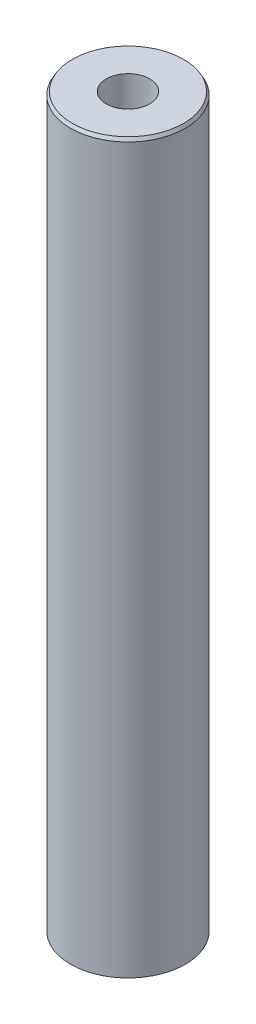
ISO-10303-21;
HEADER;
FILE_DESCRIPTION(('STEP AP214'),'2;1');
FILE_NAME('part.step','',(''),(''),'','','');
FILE_SCHEMA(('AUTOMOTIVE_DESIGN { 1 0 10303 214 1 1 1 1 }'));
ENDSEC;
DATA;
#1=APPLICATION_CONTEXT('core data for automotive mechanical design processes');
#2=APPLICATION_PROTOCOL_DEFINITION('international standard','automotive_design',2000,#1);
#3=PRODUCT_CONTEXT('',#1,'mechanical');
#4=PRODUCT('Part','Part','',(#3));
#5=PRODUCT_RELATED_PRODUCT_CATEGORY('part','',(#4));
#6=PRODUCT_DEFINITION_FORMATION('','',#4);
#7=PRODUCT_DEFINITION_CONTEXT('part definition',#1,'design');
#8=PRODUCT_DEFINITION('design','',#6,#7);
#9=PRODUCT_DEFINITION_SHAPE('','',#8);
#10=(LENGTH_UNIT() NAMED_UNIT(*) SI_UNIT(.MILLI.,.METRE.));
#11=(NAMED_UNIT(*) PLANE_ANGLE_UNIT() SI_UNIT($,.RADIAN.));
#12=(NAMED_UNIT(*) SI_UNIT($,.STERADIAN.) SOLID_ANGLE_UNIT());
#13=UNCERTAINTY_MEASURE_WITH_UNIT(LENGTH_MEASURE(1.E-05),#10,'distance_accuracy_value','');
#14=(GEOMETRIC_REPRESENTATION_CONTEXT(3) GLOBAL_UNCERTAINTY_ASSIGNED_CONTEXT((#13)) GLOBAL_UNIT_ASSIGNED_CONTEXT((#10,
#11,#12)) REPRESENTATION_CONTEXT('',''));
#15=CARTESIAN_POINT('',(0.,0.,0.));
#16=DIRECTION('',(0.,0.,1.));
#17=DIRECTION('',(1.,0.,0.));
#18=AXIS2_PLACEMENT_3D('',#15,#16,#17);
#19=CARTESIAN_POINT('',(0.,571.017711659267,0.));
#20=DIRECTION('',(0.,-1.,0.));
#21=DIRECTION('',(0.,0.,-1.));
#22=AXIS2_PLACEMENT_3D('',#19,#20,#21);
#23=CYLINDRICAL_SURFACE('',#22,45.);
#24=CARTESIAN_POINT('',(0.,568.477892674003,0.));
#25=DIRECTION('',(0.,1.,0.));
#26=DIRECTION('',(0.,0.,1.));
#27=AXIS2_PLACEMENT_3D('',#24,#25,#26);
#28=CIRCLE('',#27,45.);
#29=CARTESIAN_POINT('',(0.,568.477892674003,45.));
#30=VERTEX_POINT('',#29);
#31=EDGE_CURVE('E50',#30,#30,#28,.F.);
#32=ORIENTED_EDGE('',*,*,#31,.T.);
#33=EDGE_LOOP('',(#32));
#34=FACE_BOUND('',#33,.T.);
#35=CARTESIAN_POINT('',(0.,1.46636517483456,0.));
#36=DIRECTION('',(0.,1.,0.));
#37=DIRECTION('',(0.,0.,1.));
#38=AXIS2_PLACEMENT_3D('',#35,#36,#37);
#39=CIRCLE('',#38,45.);
#40=CARTESIAN_POINT('',(0.,1.46636517483456,45.));
#41=VERTEX_POINT('',#40);
#42=EDGE_CURVE('E51',#41,#41,#39,.T.);
#43=ORIENTED_EDGE('',*,*,#42,.T.);
#44=EDGE_LOOP('',(#43));
#45=FACE_BOUND('',#44,.T.);
#46=ADVANCED_FACE('F39',(#34,#45),#23,.T.);
#47=CARTESIAN_POINT('',(0.,571.017711659267,0.));
#48=DIRECTION('',(0.,1.,0.));
#49=DIRECTION('',(0.,0.,1.));
#50=AXIS2_PLACEMENT_3D('',#47,#48,#49);
#51=PLANE('',#50);
#52=CARTESIAN_POINT('',(0.,571.017711659267,0.));
#53=DIRECTION('',(0.,1.,0.));
#54=DIRECTION('',(0.,0.,1.));
#55=AXIS2_PLACEMENT_3D('',#52,#53,#54);
#56=CIRCLE('',#55,43.5336348251653);
#57=CARTESIAN_POINT('',(0.,571.017711659267,43.5336348251653));
#58=VERTEX_POINT('',#57);
#59=EDGE_CURVE('E54',#58,#58,#56,.T.);
#60=ORIENTED_EDGE('',*,*,#59,.T.);
#61=EDGE_LOOP('',(#60));
#62=FACE_BOUND('',#61,.T.);
#63=CARTESIAN_POINT('',(0.,571.017711659267,0.));
#64=DIRECTION('',(0.,1.,0.));
#65=DIRECTION('',(0.,0.,1.));
#66=AXIS2_PLACEMENT_3D('',#63,#64,#65);
#67=CIRCLE('',#66,17.0117587069498);
#68=CARTESIAN_POINT('',(0.,571.017711659267,17.0117587069498));
#69=VERTEX_POINT('',#68);
#70=EDGE_CURVE('E58',#69,#69,#67,.T.);
#71=ORIENTED_EDGE('',*,*,#70,.F.);
#72=EDGE_LOOP('',(#71));
#73=FACE_BOUND('',#72,.T.);
#74=ADVANCED_FACE('F69',(#62,#73),#51,.T.);
#75=CARTESIAN_POINT('',(0.,0.,0.));
#76=DIRECTION('',(0.,1.,0.));
#77=DIRECTION('',(0.,0.,1.));
#78=AXIS2_PLACEMENT_3D('',#75,#76,#77);
#79=PLANE('',#78);
#80=CARTESIAN_POINT('',(0.,0.,0.));
#81=DIRECTION('',(0.,1.,0.));
#82=DIRECTION('',(0.,0.,1.));
#83=AXIS2_PLACEMENT_3D('',#80,#81,#82);
#84=CIRCLE('',#83,42.4601810147368);
#85=CARTESIAN_POINT('',(0.,0.,42.4601810147368));
#86=VERTEX_POINT('',#85);
#87=EDGE_CURVE('E10',#86,#86,#84,.F.);
#88=ORIENTED_EDGE('',*,*,#87,.T.);
#89=EDGE_LOOP('',(#88));
#90=FACE_BOUND('',#89,.T.);
#91=CARTESIAN_POINT('',(0.,0.,0.));
#92=DIRECTION('',(0.,1.,0.));
#93=DIRECTION('',(0.,0.,1.));
#94=AXIS2_PLACEMENT_3D('',#91,#92,#93);
#95=CIRCLE('',#94,17.0117587069498);
#96=CARTESIAN_POINT('',(0.,0.,17.0117587069498));
#97=VERTEX_POINT('',#96);
#98=EDGE_CURVE('E63',#97,#97,#95,.T.);
#99=ORIENTED_EDGE('',*,*,#98,.T.);
#100=EDGE_LOOP('',(#99));
#101=FACE_BOUND('',#100,.T.);
#102=ADVANCED_FACE('F75',(#90,#101),#79,.F.);
#103=CARTESIAN_POINT('',(0.,571.017711659267,0.));
#104=DIRECTION('',(0.,-1.,0.));
#105=DIRECTION('',(0.,0.,-1.));
#106=AXIS2_PLACEMENT_3D('',#103,#104,#105);
#107=CYLINDRICAL_SURFACE('',#106,17.0117587069498);
#108=ORIENTED_EDGE('',*,*,#70,.T.);
#109=EDGE_LOOP('',(#108));
#110=FACE_BOUND('',#109,.T.);
#111=ORIENTED_EDGE('',*,*,#98,.F.);
#112=EDGE_LOOP('',(#111));
#113=FACE_BOUND('',#112,.T.);
#114=ADVANCED_FACE('F70',(#110,#113),#107,.F.);
#115=CARTESIAN_POINT('',(0.,571.017711659267,0.));
#116=DIRECTION('',(0.,-1.,0.));
#117=DIRECTION('',(0.,0.,-1.));
#118=AXIS2_PLACEMENT_3D('',#115,#116,#117);
#119=CONICAL_SURFACE('',#118,43.5336348251653,0.523598775598312);
#120=ORIENTED_EDGE('',*,*,#31,.F.);
#121=EDGE_LOOP('',(#120));
#122=FACE_BOUND('',#121,.T.);
#123=ORIENTED_EDGE('',*,*,#59,.F.);
#124=EDGE_LOOP('',(#123));
#125=FACE_BOUND('',#124,.T.);
#126=ADVANCED_FACE('F81',(#122,#125),#119,.T.);
#127=CARTESIAN_POINT('',(0.,1.46636517483456,0.));
#128=DIRECTION('',(0.,1.,0.));
#129=DIRECTION('',(0.,0.,1.));
#130=AXIS2_PLACEMENT_3D('',#127,#128,#129);
#131=CONICAL_SURFACE('',#130,45.,1.04719755119662);
#132=ORIENTED_EDGE('',*,*,#87,.F.);
#133=EDGE_LOOP('',(#132));
#134=FACE_BOUND('',#133,.T.);
#135=ORIENTED_EDGE('',*,*,#42,.F.);
#136=EDGE_LOOP('',(#135));
#137=FACE_BOUND('',#136,.T.);
#138=ADVANCED_FACE('F45',(#134,#137),#131,.T.);
#139=CLOSED_SHELL('',(#46,#74,#102,#114,#126,#138));
#140=MANIFOLD_SOLID_BREP('B2',#139);
#141=ADVANCED_BREP_SHAPE_REPRESENTATION('',(#18,#140),#14);
#142=SHAPE_DEFINITION_REPRESENTATION(#9,#141);
ENDSEC;
END-ISO-10303-21;
